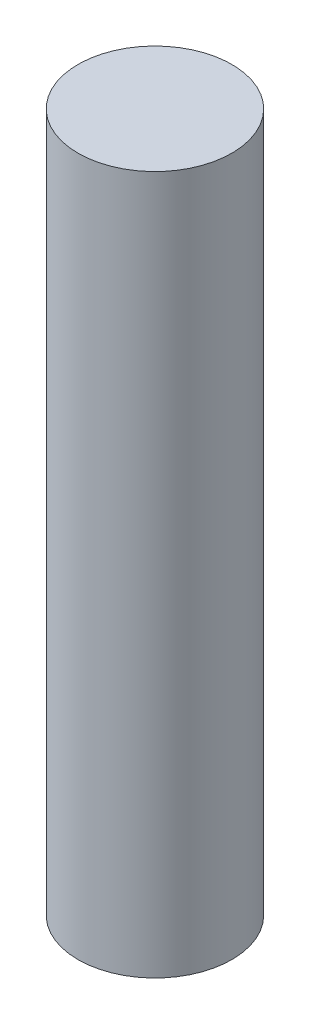
ISO-10303-21;
HEADER;
FILE_DESCRIPTION(('STEP AP214'),'2;1');
FILE_NAME('part.step','',(''),(''),'','','');
FILE_SCHEMA(('AUTOMOTIVE_DESIGN { 1 0 10303 214 1 1 1 1 }'));
ENDSEC;
DATA;
#1=APPLICATION_CONTEXT('core data for automotive mechanical design processes');
#2=APPLICATION_PROTOCOL_DEFINITION('international standard','automotive_design',2000,#1);
#3=PRODUCT_CONTEXT('',#1,'mechanical');
#4=PRODUCT('Part','Part','',(#3));
#5=PRODUCT_RELATED_PRODUCT_CATEGORY('part','',(#4));
#6=PRODUCT_DEFINITION_FORMATION('','',#4);
#7=PRODUCT_DEFINITION_CONTEXT('part definition',#1,'design');
#8=PRODUCT_DEFINITION('design','',#6,#7);
#9=PRODUCT_DEFINITION_SHAPE('','',#8);
#10=(LENGTH_UNIT() NAMED_UNIT(*) SI_UNIT(.MILLI.,.METRE.));
#11=(NAMED_UNIT(*) PLANE_ANGLE_UNIT() SI_UNIT($,.RADIAN.));
#12=(NAMED_UNIT(*) SI_UNIT($,.STERADIAN.) SOLID_ANGLE_UNIT());
#13=UNCERTAINTY_MEASURE_WITH_UNIT(LENGTH_MEASURE(1.E-05),#10,'distance_accuracy_value','');
#14=(GEOMETRIC_REPRESENTATION_CONTEXT(3) GLOBAL_UNCERTAINTY_ASSIGNED_CONTEXT((#13)) GLOBAL_UNIT_ASSIGNED_CONTEXT((#10,
#11,#12)) REPRESENTATION_CONTEXT('',''));
#15=CARTESIAN_POINT('',(0.,0.,0.));
#16=DIRECTION('',(0.,0.,1.));
#17=DIRECTION('',(1.,0.,0.));
#18=AXIS2_PLACEMENT_3D('',#15,#16,#17);
#19=CARTESIAN_POINT('',(0.,57.658,0.));
#20=DIRECTION('',(0.,-1.,0.));
#21=DIRECTION('',(0.,0.,-1.));
#22=AXIS2_PLACEMENT_3D('',#19,#20,#21);
#23=CYLINDRICAL_SURFACE('',#22,6.35);
#24=CARTESIAN_POINT('',(0.,57.658,0.));
#25=DIRECTION('',(0.,1.,0.));
#26=DIRECTION('',(0.,0.,1.));
#27=AXIS2_PLACEMENT_3D('',#24,#25,#26);
#28=CIRCLE('',#27,6.35);
#29=CARTESIAN_POINT('',(0.,57.658,6.35));
#30=VERTEX_POINT('',#29);
#31=EDGE_CURVE('E10',#30,#30,#28,.T.);
#32=ORIENTED_EDGE('',*,*,#31,.F.);
#33=EDGE_LOOP('',(#32));
#34=FACE_BOUND('',#33,.T.);
#35=CARTESIAN_POINT('',(0.,0.,0.));
#36=DIRECTION('',(0.,1.,0.));
#37=DIRECTION('',(0.,0.,1.));
#38=AXIS2_PLACEMENT_3D('',#35,#36,#37);
#39=CIRCLE('',#38,6.35);
#40=CARTESIAN_POINT('',(0.,0.,6.35));
#41=VERTEX_POINT('',#40);
#42=EDGE_CURVE('E33',#41,#41,#39,.T.);
#43=ORIENTED_EDGE('',*,*,#42,.T.);
#44=EDGE_LOOP('',(#43));
#45=FACE_BOUND('',#44,.T.);
#46=ADVANCED_FACE('F30',(#34,#45),#23,.T.);
#47=CARTESIAN_POINT('',(0.,57.658,0.));
#48=DIRECTION('',(0.,1.,0.));
#49=DIRECTION('',(0.,0.,1.));
#50=AXIS2_PLACEMENT_3D('',#47,#48,#49);
#51=PLANE('',#50);
#52=ORIENTED_EDGE('',*,*,#31,.T.);
#53=EDGE_LOOP('',(#52));
#54=FACE_BOUND('',#53,.T.);
#55=ADVANCED_FACE('F45',(#54),#51,.T.);
#56=CARTESIAN_POINT('',(0.,0.,0.));
#57=DIRECTION('',(0.,1.,0.));
#58=DIRECTION('',(0.,0.,1.));
#59=AXIS2_PLACEMENT_3D('',#56,#57,#58);
#60=PLANE('',#59);
#61=ORIENTED_EDGE('',*,*,#42,.F.);
#62=EDGE_LOOP('',(#61));
#63=FACE_BOUND('',#62,.T.);
#64=ADVANCED_FACE('F43',(#63),#60,.F.);
#65=CLOSED_SHELL('',(#46,#55,#64));
#66=MANIFOLD_SOLID_BREP('B2',#65);
#67=ADVANCED_BREP_SHAPE_REPRESENTATION('',(#18,#66),#14);
#68=SHAPE_DEFINITION_REPRESENTATION(#9,#67);
ENDSEC;
END-ISO-10303-21;
